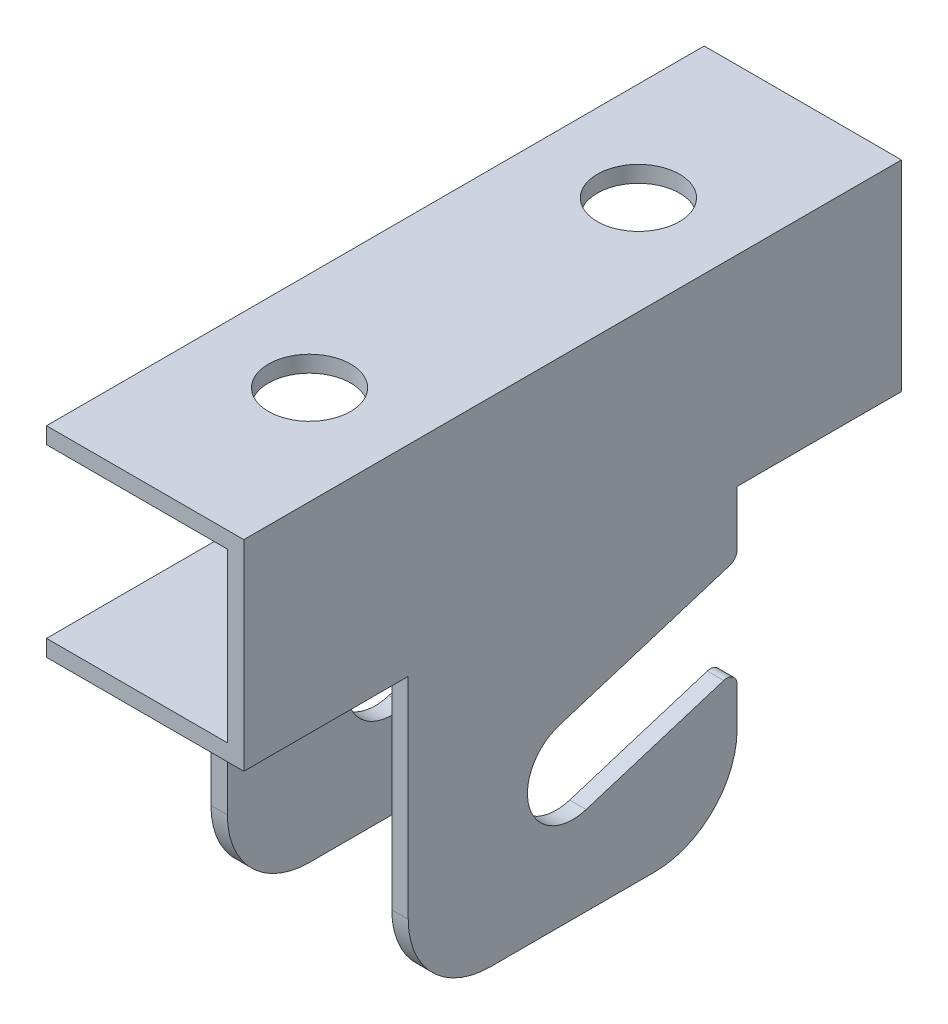
ISO-10303-21;
HEADER;
FILE_DESCRIPTION(('STEP AP214'),'2;1');
FILE_NAME('part.step','',(''),(''),'','','');
FILE_SCHEMA(('AUTOMOTIVE_DESIGN { 1 0 10303 214 1 1 1 1 }'));
ENDSEC;
DATA;
#1=APPLICATION_CONTEXT('core data for automotive mechanical design processes');
#2=APPLICATION_PROTOCOL_DEFINITION('international standard','automotive_design',2000,#1);
#3=PRODUCT_CONTEXT('',#1,'mechanical');
#4=PRODUCT('Part','Part','',(#3));
#5=PRODUCT_RELATED_PRODUCT_CATEGORY('part','',(#4));
#6=PRODUCT_DEFINITION_FORMATION('','',#4);
#7=PRODUCT_DEFINITION_CONTEXT('part definition',#1,'design');
#8=PRODUCT_DEFINITION('design','',#6,#7);
#9=PRODUCT_DEFINITION_SHAPE('','',#8);
#10=(LENGTH_UNIT() NAMED_UNIT(*) SI_UNIT(.MILLI.,.METRE.));
#11=(NAMED_UNIT(*) PLANE_ANGLE_UNIT() SI_UNIT($,.RADIAN.));
#12=(NAMED_UNIT(*) SI_UNIT($,.STERADIAN.) SOLID_ANGLE_UNIT());
#13=UNCERTAINTY_MEASURE_WITH_UNIT(LENGTH_MEASURE(1.E-05),#10,'distance_accuracy_value','');
#14=(GEOMETRIC_REPRESENTATION_CONTEXT(3) GLOBAL_UNCERTAINTY_ASSIGNED_CONTEXT((#13)) GLOBAL_UNIT_ASSIGNED_CONTEXT((#10,
#11,#12)) REPRESENTATION_CONTEXT('',''));
#15=CARTESIAN_POINT('',(0.,0.,0.));
#16=DIRECTION('',(0.,0.,1.));
#17=DIRECTION('',(1.,0.,0.));
#18=AXIS2_PLACEMENT_3D('',#15,#16,#17);
#19=CARTESIAN_POINT('',(0.,45.212,-25.4));
#20=DIRECTION('',(0.,0.,1.));
#21=DIRECTION('',(0.,-1.,0.));
#22=AXIS2_PLACEMENT_3D('',#19,#20,#21);
#23=PLANE('',#22);
#24=DIRECTION('',(0.,1.,0.));
#25=VECTOR('',#24,1.);
#26=CARTESIAN_POINT('',(30.48,76.2,-25.4));
#27=LINE('',#26,#25);
#28=CARTESIAN_POINT('',(30.48,36.7277490060236,-25.4));
#29=VERTEX_POINT('',#28);
#30=CARTESIAN_POINT('',(30.48,45.212,-25.4));
#31=VERTEX_POINT('',#30);
#32=EDGE_CURVE('E418',#29,#31,#27,.T.);
#33=ORIENTED_EDGE('',*,*,#32,.F.);
#34=DIRECTION('',(1.,0.,0.));
#35=VECTOR('',#34,1.);
#36=CARTESIAN_POINT('',(0.,36.7277490060236,-25.4));
#37=LINE('',#36,#35);
#38=CARTESIAN_POINT('',(27.94,36.7277490060236,-25.4));
#39=VERTEX_POINT('',#38);
#40=EDGE_CURVE('E495',#29,#39,#37,.F.);
#41=ORIENTED_EDGE('',*,*,#40,.T.);
#42=DIRECTION('',(0.,-1.,0.));
#43=VECTOR('',#42,1.);
#44=CARTESIAN_POINT('',(27.94,0.,-25.4));
#45=LINE('',#44,#43);
#46=CARTESIAN_POINT('',(27.94,45.212,-25.4));
#47=VERTEX_POINT('',#46);
#48=EDGE_CURVE('E336',#47,#39,#45,.T.);
#49=ORIENTED_EDGE('',*,*,#48,.F.);
#50=DIRECTION('',(1.,0.,0.));
#51=VECTOR('',#50,1.);
#52=CARTESIAN_POINT('',(0.,45.212,-25.4));
#53=LINE('',#52,#51);
#54=EDGE_CURVE('E327',#47,#31,#53,.T.);
#55=ORIENTED_EDGE('',*,*,#54,.T.);
#56=EDGE_LOOP('',(#33,#41,#49,#55));
#57=FACE_BOUND('',#56,.T.);
#58=ADVANCED_FACE('F41',(#57),#23,.F.);
#59=DIRECTION('',(0.,1.,0.));
#60=VECTOR('',#59,1.);
#61=CARTESIAN_POINT('',(2.54,45.212,-25.4));
#62=LINE('',#61,#60);
#63=CARTESIAN_POINT('',(2.54,36.7277490060236,-25.4));
#64=VERTEX_POINT('',#63);
#65=CARTESIAN_POINT('',(2.54,45.212,-25.4));
#66=VERTEX_POINT('',#65);
#67=EDGE_CURVE('E339',#64,#66,#62,.T.);
#68=ORIENTED_EDGE('',*,*,#67,.F.);
#69=DIRECTION('',(1.,0.,0.));
#70=VECTOR('',#69,1.);
#71=CARTESIAN_POINT('',(0.,36.7277490060236,-25.4));
#72=LINE('',#71,#70);
#73=CARTESIAN_POINT('',(0.,36.7277490060236,-25.4));
#74=VERTEX_POINT('',#73);
#75=EDGE_CURVE('E482',#64,#74,#72,.F.);
#76=ORIENTED_EDGE('',*,*,#75,.T.);
#77=DIRECTION('',(0.,-1.,0.));
#78=VECTOR('',#77,1.);
#79=CARTESIAN_POINT('',(0.,45.212,-25.4));
#80=LINE('',#79,#78);
#81=CARTESIAN_POINT('',(0.,45.212,-25.4));
#82=VERTEX_POINT('',#81);
#83=EDGE_CURVE('E325',#82,#74,#80,.T.);
#84=ORIENTED_EDGE('',*,*,#83,.F.);
#85=EDGE_CURVE('E314',#82,#66,#53,.T.);
#86=ORIENTED_EDGE('',*,*,#85,.T.);
#87=EDGE_LOOP('',(#68,#76,#84,#86));
#88=FACE_BOUND('',#87,.T.);
#89=ADVANCED_FACE('F564',(#88),#23,.F.);
#90=CARTESIAN_POINT('',(0.,0.,50.8));
#91=DIRECTION('',(1.,0.,0.));
#92=DIRECTION('',(0.,0.,-1.));
#93=AXIS2_PLACEMENT_3D('',#90,#91,#92);
#94=PLANE('',#93);
#95=ORIENTED_EDGE('',*,*,#83,.T.);
#96=CARTESIAN_POINT('',(0.,36.7277490060236,-23.8125));
#97=DIRECTION('',(1.,0.,0.));
#98=DIRECTION('',(0.,0.,-1.));
#99=AXIS2_PLACEMENT_3D('',#96,#97,#98);
#100=CIRCLE('',#99,1.5875);
#101=CARTESIAN_POINT('',(0.,35.212266999136,-24.2852267041325));
#102=VERTEX_POINT('',#101);
#103=EDGE_CURVE('E486',#74,#102,#100,.F.);
#104=ORIENTED_EDGE('',*,*,#103,.T.);
#105=DIRECTION('',(0.,-0.297780601028374,0.95463433504729));
#106=VECTOR('',#105,1.);
#107=CARTESIAN_POINT('',(0.,26.9881208303053,2.07999749818319));
#108=LINE('',#107,#106);
#109=CARTESIAN_POINT('',(0.,26.9881208303053,2.07999749818319));
#110=VERTEX_POINT('',#109);
#111=EDGE_CURVE('E270',#102,#110,#108,.T.);
#112=ORIENTED_EDGE('',*,*,#111,.T.);
#113=CARTESIAN_POINT('',(0.,20.32,0.));
#114=DIRECTION('',(1.,0.,0.));
#115=DIRECTION('',(0.,0.,-1.));
#116=AXIS2_PLACEMENT_3D('',#113,#114,#115);
#117=CIRCLE('',#116,6.985);
#118=CARTESIAN_POINT('',(0.,13.6518791696947,-2.07999749818319));
#119=VERTEX_POINT('',#118);
#120=EDGE_CURVE('E255',#110,#119,#117,.T.);
#121=ORIENTED_EDGE('',*,*,#120,.T.);
#122=DIRECTION('',(0.,0.297780601028374,-0.954634335047289));
#123=VECTOR('',#122,1.);
#124=CARTESIAN_POINT('',(0.,13.6518791696947,-2.07999749818319));
#125=LINE('',#124,#123);
#126=CARTESIAN_POINT('',(0.,20.2834747265937,-23.3397732958675));
#127=VERTEX_POINT('',#126);
#128=EDGE_CURVE('E264',#119,#127,#125,.T.);
#129=ORIENTED_EDGE('',*,*,#128,.T.);
#130=CARTESIAN_POINT('',(0.,18.7679927197062,-23.8125));
#131=DIRECTION('',(1.,0.,0.));
#132=DIRECTION('',(0.,0.,-1.));
#133=AXIS2_PLACEMENT_3D('',#130,#131,#132);
#134=CIRCLE('',#133,1.5875);
#135=CARTESIAN_POINT('',(0.,18.7679927197062,-25.4));
#136=VERTEX_POINT('',#135);
#137=EDGE_CURVE('E484',#127,#136,#134,.F.);
#138=ORIENTED_EDGE('',*,*,#137,.T.);
#139=CARTESIAN_POINT('',(0.,12.7,-25.4));
#140=VERTEX_POINT('',#139);
#141=EDGE_CURVE('E324',#136,#140,#80,.T.);
#142=ORIENTED_EDGE('',*,*,#141,.T.);
#143=CARTESIAN_POINT('',(0.,12.7,-12.7));
#144=DIRECTION('',(1.,0.,0.));
#145=DIRECTION('',(0.,0.,-1.));
#146=AXIS2_PLACEMENT_3D('',#143,#144,#145);
#147=CIRCLE('',#146,12.7);
#148=CARTESIAN_POINT('',(0.,0.,-12.7));
#149=VERTEX_POINT('',#148);
#150=EDGE_CURVE('E465',#140,#149,#147,.F.);
#151=ORIENTED_EDGE('',*,*,#150,.T.);
#152=DIRECTION('',(0.,0.,-1.));
#153=VECTOR('',#152,1.);
#154=CARTESIAN_POINT('',(0.,0.,50.8));
#155=LINE('',#154,#153);
#156=CARTESIAN_POINT('',(0.,0.,12.7));
#157=VERTEX_POINT('',#156);
#158=EDGE_CURVE('E415',#157,#149,#155,.T.);
#159=ORIENTED_EDGE('',*,*,#158,.F.);
#160=CARTESIAN_POINT('',(0.,12.7,12.7));
#161=DIRECTION('',(1.,0.,0.));
#162=DIRECTION('',(0.,0.,-1.));
#163=AXIS2_PLACEMENT_3D('',#160,#161,#162);
#164=CIRCLE('',#163,12.7);
#165=CARTESIAN_POINT('',(0.,12.7,25.4));
#166=VERTEX_POINT('',#165);
#167=EDGE_CURVE('E467',#157,#166,#164,.F.);
#168=ORIENTED_EDGE('',*,*,#167,.T.);
#169=DIRECTION('',(0.,1.,0.));
#170=VECTOR('',#169,1.);
#171=CARTESIAN_POINT('',(0.,45.212,25.4));
#172=LINE('',#171,#170);
#173=CARTESIAN_POINT('',(0.,45.212,25.4));
#174=VERTEX_POINT('',#173);
#175=EDGE_CURVE('E311',#166,#174,#172,.T.);
#176=ORIENTED_EDGE('',*,*,#175,.T.);
#177=DIRECTION('',(0.,0.,1.));
#178=VECTOR('',#177,1.);
#179=CARTESIAN_POINT('',(0.,45.212,50.8));
#180=LINE('',#179,#178);
#181=CARTESIAN_POINT('',(0.,45.212,50.8));
#182=VERTEX_POINT('',#181);
#183=EDGE_CURVE('E313',#174,#182,#180,.T.);
#184=ORIENTED_EDGE('',*,*,#183,.T.);
#185=DIRECTION('',(0.,-1.,0.));
#186=VECTOR('',#185,1.);
#187=CARTESIAN_POINT('',(0.,0.,50.8));
#188=LINE('',#187,#186);
#189=CARTESIAN_POINT('',(0.,47.752,50.8));
#190=VERTEX_POINT('',#189);
#191=EDGE_CURVE('E349',#190,#182,#188,.T.);
#192=ORIENTED_EDGE('',*,*,#191,.F.);
#193=DIRECTION('',(0.,0.,-1.));
#194=VECTOR('',#193,1.);
#195=CARTESIAN_POINT('',(0.,47.752,50.8));
#196=LINE('',#195,#194);
#197=CARTESIAN_POINT('',(0.,47.752,-50.8));
#198=VERTEX_POINT('',#197);
#199=EDGE_CURVE('E367',#190,#198,#196,.T.);
#200=ORIENTED_EDGE('',*,*,#199,.T.);
#201=DIRECTION('',(0.,-1.,0.));
#202=VECTOR('',#201,1.);
#203=CARTESIAN_POINT('',(0.,0.,-50.8));
#204=LINE('',#203,#202);
#205=CARTESIAN_POINT('',(0.,45.212,-50.8));
#206=VERTEX_POINT('',#205);
#207=EDGE_CURVE('E348',#198,#206,#204,.T.);
#208=ORIENTED_EDGE('',*,*,#207,.T.);
#209=DIRECTION('',(0.,0.,1.));
#210=VECTOR('',#209,1.);
#211=CARTESIAN_POINT('',(0.,45.212,-50.8));
#212=LINE('',#211,#210);
#213=EDGE_CURVE('E310',#206,#82,#212,.T.);
#214=ORIENTED_EDGE('',*,*,#213,.T.);
#215=EDGE_LOOP('',(#95,#104,#112,#121,#129,#138,#142,#151,#159,#168,#176,#184,#192,#200,#208,#214));
#216=FACE_BOUND('',#215,.T.);
#217=ADVANCED_FACE('F273',(#216),#94,.F.);
#218=CARTESIAN_POINT('',(2.54,0.,50.8));
#219=DIRECTION('',(0.,1.,0.));
#220=DIRECTION('',(-1.,0.,0.));
#221=AXIS2_PLACEMENT_3D('',#218,#219,#220);
#222=PLANE('',#221);
#223=DIRECTION('',(0.,0.,-1.));
#224=VECTOR('',#223,1.);
#225=CARTESIAN_POINT('',(2.54,0.,50.8));
#226=LINE('',#225,#224);
#227=CARTESIAN_POINT('',(2.54,0.,12.7));
#228=VERTEX_POINT('',#227);
#229=CARTESIAN_POINT('',(2.54,0.,-12.7));
#230=VERTEX_POINT('',#229);
#231=EDGE_CURVE('E412',#228,#230,#226,.T.);
#232=ORIENTED_EDGE('',*,*,#231,.F.);
#233=DIRECTION('',(1.,0.,0.));
#234=VECTOR('',#233,1.);
#235=CARTESIAN_POINT('',(2.54,0.,12.7));
#236=LINE('',#235,#234);
#237=EDGE_CURVE('E463',#228,#157,#236,.F.);
#238=ORIENTED_EDGE('',*,*,#237,.T.);
#239=ORIENTED_EDGE('',*,*,#158,.T.);
#240=DIRECTION('',(1.,0.,0.));
#241=VECTOR('',#240,1.);
#242=CARTESIAN_POINT('',(2.54,0.,-12.7));
#243=LINE('',#242,#241);
#244=EDGE_CURVE('E460',#149,#230,#243,.T.);
#245=ORIENTED_EDGE('',*,*,#244,.T.);
#246=EDGE_LOOP('',(#232,#238,#239,#245));
#247=FACE_BOUND('',#246,.T.);
#248=ADVANCED_FACE('F597',(#247),#222,.F.);
#249=CARTESIAN_POINT('',(2.54,45.212,50.8));
#250=DIRECTION('',(-1.,0.,0.));
#251=DIRECTION('',(0.,-1.,0.));
#252=AXIS2_PLACEMENT_3D('',#249,#250,#251);
#253=PLANE('',#252);
#254=DIRECTION('',(0.,0.297780601028374,-0.954634335047289));
#255=VECTOR('',#254,1.);
#256=CARTESIAN_POINT('',(2.54,14.7543797026228,41.2993062316392));
#257=LINE('',#256,#255);
#258=CARTESIAN_POINT('',(2.54,26.9881208303053,2.07999749818319));
#259=VERTEX_POINT('',#258);
#260=CARTESIAN_POINT('',(2.54,35.212266999136,-24.2852267041325));
#261=VERTEX_POINT('',#260);
#262=EDGE_CURVE('E303',#259,#261,#257,.T.);
#263=ORIENTED_EDGE('',*,*,#262,.T.);
#264=CARTESIAN_POINT('',(2.54,36.7277490060236,-23.8125));
#265=DIRECTION('',(-1.,0.,0.));
#266=DIRECTION('',(0.,-1.,0.));
#267=AXIS2_PLACEMENT_3D('',#264,#265,#266);
#268=CIRCLE('',#267,1.5875);
#269=EDGE_CURVE('E480',#261,#64,#268,.F.);
#270=ORIENTED_EDGE('',*,*,#269,.T.);
#271=ORIENTED_EDGE('',*,*,#67,.T.);
#272=DIRECTION('',(0.,0.,-1.));
#273=VECTOR('',#272,1.);
#274=CARTESIAN_POINT('',(2.54,45.212,50.8));
#275=LINE('',#274,#273);
#276=CARTESIAN_POINT('',(2.54,45.212,25.4));
#277=VERTEX_POINT('',#276);
#278=EDGE_CURVE('E409',#277,#66,#275,.T.);
#279=ORIENTED_EDGE('',*,*,#278,.F.);
#280=DIRECTION('',(0.,-1.,0.));
#281=VECTOR('',#280,1.);
#282=CARTESIAN_POINT('',(2.54,45.212,25.4));
#283=LINE('',#282,#281);
#284=CARTESIAN_POINT('',(2.54,12.7,25.4));
#285=VERTEX_POINT('',#284);
#286=EDGE_CURVE('E345',#277,#285,#283,.T.);
#287=ORIENTED_EDGE('',*,*,#286,.T.);
#288=CARTESIAN_POINT('',(2.54,12.7,12.7));
#289=DIRECTION('',(-1.,0.,0.));
#290=DIRECTION('',(0.,-1.,0.));
#291=AXIS2_PLACEMENT_3D('',#288,#289,#290);
#292=CIRCLE('',#291,12.7);
#293=EDGE_CURVE('E458',#285,#228,#292,.F.);
#294=ORIENTED_EDGE('',*,*,#293,.T.);
#295=ORIENTED_EDGE('',*,*,#231,.T.);
#296=CARTESIAN_POINT('',(2.54,12.7,-12.7));
#297=DIRECTION('',(-1.,0.,0.));
#298=DIRECTION('',(0.,-1.,0.));
#299=AXIS2_PLACEMENT_3D('',#296,#297,#298);
#300=CIRCLE('',#299,12.7);
#301=CARTESIAN_POINT('',(2.54,12.7,-25.4));
#302=VERTEX_POINT('',#301);
#303=EDGE_CURVE('E456',#230,#302,#300,.F.);
#304=ORIENTED_EDGE('',*,*,#303,.T.);
#305=CARTESIAN_POINT('',(2.54,18.7679927197062,-25.4));
#306=VERTEX_POINT('',#305);
#307=EDGE_CURVE('E340',#302,#306,#62,.T.);
#308=ORIENTED_EDGE('',*,*,#307,.T.);
#309=CARTESIAN_POINT('',(2.54,18.7679927197062,-23.8125));
#310=DIRECTION('',(-1.,0.,0.));
#311=DIRECTION('',(0.,-1.,0.));
#312=AXIS2_PLACEMENT_3D('',#309,#310,#311);
#313=CIRCLE('',#312,1.5875);
#314=CARTESIAN_POINT('',(2.54,20.2834747265937,-23.3397732958675));
#315=VERTEX_POINT('',#314);
#316=EDGE_CURVE('E478',#306,#315,#313,.F.);
#317=ORIENTED_EDGE('',*,*,#316,.T.);
#318=DIRECTION('',(0.,-0.297780601028374,0.95463433504729));
#319=VECTOR('',#318,1.);
#320=CARTESIAN_POINT('',(2.54,1.41813804201213,37.1393112352729));
#321=LINE('',#320,#319);
#322=CARTESIAN_POINT('',(2.54,13.6518791696947,-2.07999749818319));
#323=VERTEX_POINT('',#322);
#324=EDGE_CURVE('E296',#315,#323,#321,.T.);
#325=ORIENTED_EDGE('',*,*,#324,.T.);
#326=CARTESIAN_POINT('',(2.54,20.32,0.));
#327=DIRECTION('',(-1.,0.,0.));
#328=DIRECTION('',(0.,-1.,0.));
#329=AXIS2_PLACEMENT_3D('',#326,#327,#328);
#330=CIRCLE('',#329,6.985);
#331=EDGE_CURVE('E257',#323,#259,#330,.T.);
#332=ORIENTED_EDGE('',*,*,#331,.T.);
#333=EDGE_LOOP('',(#263,#270,#271,#279,#287,#294,#295,#304,#308,#317,#325,#332));
#334=FACE_BOUND('',#333,.T.);
#335=ADVANCED_FACE('F589',(#334),#253,.F.);
#336=CARTESIAN_POINT('',(27.94,45.212,50.8));
#337=DIRECTION('',(0.,1.,0.));
#338=DIRECTION('',(0.,0.,1.));
#339=AXIS2_PLACEMENT_3D('',#336,#337,#338);
#340=PLANE('',#339);
#341=CARTESIAN_POINT('',(15.24,45.212,25.4));
#342=DIRECTION('',(0.,1.,0.));
#343=DIRECTION('',(0.,0.,1.));
#344=AXIS2_PLACEMENT_3D('',#341,#342,#343);
#345=CIRCLE('',#344,6.35);
#346=CARTESIAN_POINT('',(15.24,45.212,31.75));
#347=VERTEX_POINT('',#346);
#348=EDGE_CURVE('E276',#347,#347,#345,.T.);
#349=ORIENTED_EDGE('',*,*,#348,.T.);
#350=EDGE_LOOP('',(#349));
#351=FACE_BOUND('',#350,.T.);
#352=CARTESIAN_POINT('',(15.24,45.212,-25.4));
#353=DIRECTION('',(0.,1.,0.));
#354=DIRECTION('',(0.,0.,1.));
#355=AXIS2_PLACEMENT_3D('',#352,#353,#354);
#356=CIRCLE('',#355,6.35);
#357=CARTESIAN_POINT('',(15.24,45.212,-19.05));
#358=VERTEX_POINT('',#357);
#359=EDGE_CURVE('E437',#358,#358,#356,.T.);
#360=ORIENTED_EDGE('',*,*,#359,.T.);
#361=EDGE_LOOP('',(#360));
#362=FACE_BOUND('',#361,.T.);
#363=DIRECTION('',(0.,0.,-1.));
#364=VECTOR('',#363,1.);
#365=CARTESIAN_POINT('',(27.94,45.212,50.8));
#366=LINE('',#365,#364);
#367=CARTESIAN_POINT('',(27.94,45.212,25.4));
#368=VERTEX_POINT('',#367);
#369=EDGE_CURVE('E406',#368,#47,#366,.T.);
#370=ORIENTED_EDGE('',*,*,#369,.F.);
#371=DIRECTION('',(1.,0.,0.));
#372=VECTOR('',#371,1.);
#373=CARTESIAN_POINT('',(0.,45.212,25.4));
#374=LINE('',#373,#372);
#375=CARTESIAN_POINT('',(30.48,45.212,25.4));
#376=VERTEX_POINT('',#375);
#377=EDGE_CURVE('E317',#368,#376,#374,.T.);
#378=ORIENTED_EDGE('',*,*,#377,.T.);
#379=DIRECTION('',(0.,0.,-1.));
#380=VECTOR('',#379,1.);
#381=CARTESIAN_POINT('',(30.48,45.212,50.8));
#382=LINE('',#381,#380);
#383=CARTESIAN_POINT('',(30.48,45.212,50.8));
#384=VERTEX_POINT('',#383);
#385=EDGE_CURVE('E332',#384,#376,#382,.T.);
#386=ORIENTED_EDGE('',*,*,#385,.F.);
#387=DIRECTION('',(1.,0.,0.));
#388=VECTOR('',#387,1.);
#389=CARTESIAN_POINT('',(27.94,45.212,50.8));
#390=LINE('',#389,#388);
#391=EDGE_CURVE('E352',#182,#384,#390,.T.);
#392=ORIENTED_EDGE('',*,*,#391,.F.);
#393=ORIENTED_EDGE('',*,*,#183,.F.);
#394=EDGE_CURVE('E318',#174,#277,#374,.T.);
#395=ORIENTED_EDGE('',*,*,#394,.T.);
#396=ORIENTED_EDGE('',*,*,#278,.T.);
#397=ORIENTED_EDGE('',*,*,#85,.F.);
#398=ORIENTED_EDGE('',*,*,#213,.F.);
#399=DIRECTION('',(1.,0.,0.));
#400=VECTOR('',#399,1.);
#401=CARTESIAN_POINT('',(27.94,45.212,-50.8));
#402=LINE('',#401,#400);
#403=CARTESIAN_POINT('',(30.48,45.212,-50.8));
#404=VERTEX_POINT('',#403);
#405=EDGE_CURVE('E370',#206,#404,#402,.T.);
#406=ORIENTED_EDGE('',*,*,#405,.T.);
#407=DIRECTION('',(0.,0.,-1.));
#408=VECTOR('',#407,1.);
#409=CARTESIAN_POINT('',(30.48,45.212,50.8));
#410=LINE('',#409,#408);
#411=EDGE_CURVE('E321',#31,#404,#410,.T.);
#412=ORIENTED_EDGE('',*,*,#411,.F.);
#413=ORIENTED_EDGE('',*,*,#54,.F.);
#414=EDGE_LOOP('',(#370,#378,#386,#392,#393,#395,#396,#397,#398,#406,#412,#413));
#415=FACE_BOUND('',#414,.T.);
#416=ADVANCED_FACE('F536',(#351,#362,#415),#340,.F.);
#417=CARTESIAN_POINT('',(27.94,0.,50.8));
#418=DIRECTION('',(1.,0.,0.));
#419=DIRECTION('',(0.,1.,0.));
#420=AXIS2_PLACEMENT_3D('',#417,#418,#419);
#421=PLANE('',#420);
#422=ORIENTED_EDGE('',*,*,#48,.T.);
#423=CARTESIAN_POINT('',(27.94,36.7277490060236,-23.8125));
#424=DIRECTION('',(1.,0.,0.));
#425=DIRECTION('',(0.,1.,0.));
#426=AXIS2_PLACEMENT_3D('',#423,#424,#425);
#427=CIRCLE('',#426,1.5875);
#428=CARTESIAN_POINT('',(27.94,35.212266999136,-24.2852267041326));
#429=VERTEX_POINT('',#428);
#430=EDGE_CURVE('E498',#39,#429,#427,.F.);
#431=ORIENTED_EDGE('',*,*,#430,.T.);
#432=DIRECTION('',(0.,-0.297780601028374,0.954634335047289));
#433=VECTOR('',#432,1.);
#434=CARTESIAN_POINT('',(27.94,10.7452830802199,54.1517931802541));
#435=LINE('',#434,#433);
#436=CARTESIAN_POINT('',(27.94,26.9881208303053,2.07999749818319));
#437=VERTEX_POINT('',#436);
#438=EDGE_CURVE('E301',#429,#437,#435,.T.);
#439=ORIENTED_EDGE('',*,*,#438,.T.);
#440=CARTESIAN_POINT('',(27.94,20.32,0.));
#441=DIRECTION('',(1.,0.,0.));
#442=DIRECTION('',(0.,1.,0.));
#443=AXIS2_PLACEMENT_3D('',#440,#441,#442);
#444=CIRCLE('',#443,6.985);
#445=CARTESIAN_POINT('',(27.94,13.6518791696947,-2.07999749818319));
#446=VERTEX_POINT('',#445);
#447=EDGE_CURVE('E306',#437,#446,#444,.T.);
#448=ORIENTED_EDGE('',*,*,#447,.T.);
#449=DIRECTION('',(0.,0.297780601028374,-0.95463433504729));
#450=VECTOR('',#449,1.);
#451=CARTESIAN_POINT('',(27.94,-2.59095858039068,49.9917981838877));
#452=LINE('',#451,#450);
#453=CARTESIAN_POINT('',(27.94,20.2834747265937,-23.3397732958675));
#454=VERTEX_POINT('',#453);
#455=EDGE_CURVE('E294',#446,#454,#452,.T.);
#456=ORIENTED_EDGE('',*,*,#455,.T.);
#457=CARTESIAN_POINT('',(27.94,18.7679927197062,-23.8125));
#458=DIRECTION('',(1.,0.,0.));
#459=DIRECTION('',(0.,1.,0.));
#460=AXIS2_PLACEMENT_3D('',#457,#458,#459);
#461=CIRCLE('',#460,1.5875);
#462=CARTESIAN_POINT('',(27.94,18.7679927197062,-25.4));
#463=VERTEX_POINT('',#462);
#464=EDGE_CURVE('E56',#454,#463,#461,.F.);
#465=ORIENTED_EDGE('',*,*,#464,.T.);
#466=CARTESIAN_POINT('',(27.94,12.7,-25.4));
#467=VERTEX_POINT('',#466);
#468=EDGE_CURVE('E335',#463,#467,#45,.T.);
#469=ORIENTED_EDGE('',*,*,#468,.T.);
#470=CARTESIAN_POINT('',(27.94,12.7,-12.7));
#471=DIRECTION('',(1.,0.,0.));
#472=DIRECTION('',(0.,1.,0.));
#473=AXIS2_PLACEMENT_3D('',#470,#471,#472);
#474=CIRCLE('',#473,12.7);
#475=CARTESIAN_POINT('',(27.94,0.,-12.7));
#476=VERTEX_POINT('',#475);
#477=EDGE_CURVE('E449',#467,#476,#474,.F.);
#478=ORIENTED_EDGE('',*,*,#477,.T.);
#479=DIRECTION('',(0.,0.,-1.));
#480=VECTOR('',#479,1.);
#481=CARTESIAN_POINT('',(27.94,0.,50.8));
#482=LINE('',#481,#480);
#483=CARTESIAN_POINT('',(27.94,0.,12.7));
#484=VERTEX_POINT('',#483);
#485=EDGE_CURVE('E403',#484,#476,#482,.T.);
#486=ORIENTED_EDGE('',*,*,#485,.F.);
#487=CARTESIAN_POINT('',(27.94,12.7,12.7));
#488=DIRECTION('',(1.,0.,0.));
#489=DIRECTION('',(0.,1.,0.));
#490=AXIS2_PLACEMENT_3D('',#487,#488,#489);
#491=CIRCLE('',#490,12.7);
#492=CARTESIAN_POINT('',(27.94,12.7,25.4));
#493=VERTEX_POINT('',#492);
#494=EDGE_CURVE('E451',#484,#493,#491,.F.);
#495=ORIENTED_EDGE('',*,*,#494,.T.);
#496=DIRECTION('',(0.,1.,0.));
#497=VECTOR('',#496,1.);
#498=CARTESIAN_POINT('',(27.94,0.,25.4));
#499=LINE('',#498,#497);
#500=EDGE_CURVE('E343',#493,#368,#499,.T.);
#501=ORIENTED_EDGE('',*,*,#500,.T.);
#502=ORIENTED_EDGE('',*,*,#369,.T.);
#503=EDGE_LOOP('',(#422,#431,#439,#448,#456,#465,#469,#478,#486,#495,#501,#502));
#504=FACE_BOUND('',#503,.T.);
#505=ADVANCED_FACE('F522',(#504),#421,.F.);
#506=CARTESIAN_POINT('',(30.48,0.,50.8));
#507=DIRECTION('',(0.,1.,0.));
#508=DIRECTION('',(-1.,0.,0.));
#509=AXIS2_PLACEMENT_3D('',#506,#507,#508);
#510=PLANE('',#509);
#511=DIRECTION('',(0.,0.,-1.));
#512=VECTOR('',#511,1.);
#513=CARTESIAN_POINT('',(30.48,0.,50.8));
#514=LINE('',#513,#512);
#515=CARTESIAN_POINT('',(30.48,0.,12.7));
#516=VERTEX_POINT('',#515);
#517=CARTESIAN_POINT('',(30.48,0.,-12.7));
#518=VERTEX_POINT('',#517);
#519=EDGE_CURVE('E400',#516,#518,#514,.T.);
#520=ORIENTED_EDGE('',*,*,#519,.F.);
#521=DIRECTION('',(1.,0.,0.));
#522=VECTOR('',#521,1.);
#523=CARTESIAN_POINT('',(30.48,0.,12.7));
#524=LINE('',#523,#522);
#525=EDGE_CURVE('E447',#516,#484,#524,.F.);
#526=ORIENTED_EDGE('',*,*,#525,.T.);
#527=ORIENTED_EDGE('',*,*,#485,.T.);
#528=DIRECTION('',(1.,0.,0.));
#529=VECTOR('',#528,1.);
#530=CARTESIAN_POINT('',(30.48,0.,-12.7));
#531=LINE('',#530,#529);
#532=EDGE_CURVE('E444',#476,#518,#531,.T.);
#533=ORIENTED_EDGE('',*,*,#532,.T.);
#534=EDGE_LOOP('',(#520,#526,#527,#533));
#535=FACE_BOUND('',#534,.T.);
#536=ADVANCED_FACE('F518',(#535),#510,.F.);
#537=CARTESIAN_POINT('',(30.48,76.2,50.8));
#538=DIRECTION('',(-1.,0.,0.));
#539=DIRECTION('',(0.,0.,1.));
#540=AXIS2_PLACEMENT_3D('',#537,#538,#539);
#541=PLANE('',#540);
#542=DIRECTION('',(0.,0.297780601028374,-0.954634335047289));
#543=VECTOR('',#542,1.);
#544=CARTESIAN_POINT('',(30.48,17.5021875,32.4902983230381));
#545=LINE('',#544,#543);
#546=CARTESIAN_POINT('',(30.48,26.9881208303053,2.07999749818319));
#547=VERTEX_POINT('',#546);
#548=CARTESIAN_POINT('',(30.48,35.212266999136,-24.2852267041325));
#549=VERTEX_POINT('',#548);
#550=EDGE_CURVE('E298',#547,#549,#545,.T.);
#551=ORIENTED_EDGE('',*,*,#550,.T.);
#552=CARTESIAN_POINT('',(30.48,36.7277490060236,-23.8125));
#553=DIRECTION('',(-1.,0.,0.));
#554=DIRECTION('',(0.,0.,1.));
#555=AXIS2_PLACEMENT_3D('',#552,#553,#554);
#556=CIRCLE('',#555,1.5875);
#557=EDGE_CURVE('E493',#549,#29,#556,.F.);
#558=ORIENTED_EDGE('',*,*,#557,.T.);
#559=ORIENTED_EDGE('',*,*,#32,.T.);
#560=ORIENTED_EDGE('',*,*,#411,.T.);
#561=DIRECTION('',(0.,1.,0.));
#562=VECTOR('',#561,1.);
#563=CARTESIAN_POINT('',(30.48,76.2,-50.8));
#564=LINE('',#563,#562);
#565=CARTESIAN_POINT('',(30.48,76.2,-50.8));
#566=VERTEX_POINT('',#565);
#567=EDGE_CURVE('E372',#404,#566,#564,.T.);
#568=ORIENTED_EDGE('',*,*,#567,.T.);
#569=DIRECTION('',(0.,0.,-1.));
#570=VECTOR('',#569,1.);
#571=CARTESIAN_POINT('',(30.48,76.2,50.8));
#572=LINE('',#571,#570);
#573=CARTESIAN_POINT('',(30.48,76.2,50.8));
#574=VERTEX_POINT('',#573);
#575=EDGE_CURVE('E397',#574,#566,#572,.T.);
#576=ORIENTED_EDGE('',*,*,#575,.F.);
#577=DIRECTION('',(0.,1.,0.));
#578=VECTOR('',#577,1.);
#579=CARTESIAN_POINT('',(30.48,47.752,50.8));
#580=LINE('',#579,#578);
#581=EDGE_CURVE('E355',#384,#574,#580,.T.);
#582=ORIENTED_EDGE('',*,*,#581,.F.);
#583=ORIENTED_EDGE('',*,*,#385,.T.);
#584=DIRECTION('',(0.,-1.,0.));
#585=VECTOR('',#584,1.);
#586=CARTESIAN_POINT('',(30.48,76.2,25.4));
#587=LINE('',#586,#585);
#588=CARTESIAN_POINT('',(30.48,12.7,25.4));
#589=VERTEX_POINT('',#588);
#590=EDGE_CURVE('E422',#376,#589,#587,.T.);
#591=ORIENTED_EDGE('',*,*,#590,.T.);
#592=CARTESIAN_POINT('',(30.48,12.7,12.7));
#593=DIRECTION('',(-1.,0.,0.));
#594=DIRECTION('',(0.,0.,1.));
#595=AXIS2_PLACEMENT_3D('',#592,#593,#594);
#596=CIRCLE('',#595,12.7);
#597=EDGE_CURVE('E442',#589,#516,#596,.F.);
#598=ORIENTED_EDGE('',*,*,#597,.T.);
#599=ORIENTED_EDGE('',*,*,#519,.T.);
#600=CARTESIAN_POINT('',(30.48,12.7,-12.7));
#601=DIRECTION('',(-1.,0.,0.));
#602=DIRECTION('',(0.,0.,1.));
#603=AXIS2_PLACEMENT_3D('',#600,#601,#602);
#604=CIRCLE('',#603,12.7);
#605=CARTESIAN_POINT('',(30.48,12.7,-25.4));
#606=VERTEX_POINT('',#605);
#607=EDGE_CURVE('E440',#518,#606,#604,.F.);
#608=ORIENTED_EDGE('',*,*,#607,.T.);
#609=CARTESIAN_POINT('',(30.48,18.7679927197062,-25.4));
#610=VERTEX_POINT('',#609);
#611=EDGE_CURVE('E419',#606,#610,#27,.T.);
#612=ORIENTED_EDGE('',*,*,#611,.T.);
#613=CARTESIAN_POINT('',(30.48,18.7679927197062,-23.8125));
#614=DIRECTION('',(-1.,0.,0.));
#615=DIRECTION('',(0.,0.,1.));
#616=AXIS2_PLACEMENT_3D('',#613,#614,#615);
#617=CIRCLE('',#616,1.5875);
#618=CARTESIAN_POINT('',(30.48,20.2834747265937,-23.3397732958675));
#619=VERTEX_POINT('',#618);
#620=EDGE_CURVE('E491',#610,#619,#617,.F.);
#621=ORIENTED_EDGE('',*,*,#620,.T.);
#622=DIRECTION('',(0.,-0.297780601028374,0.95463433504729));
#623=VECTOR('',#622,1.);
#624=CARTESIAN_POINT('',(30.48,4.16594583938934,28.3303033266717));
#625=LINE('',#624,#623);
#626=CARTESIAN_POINT('',(30.48,13.6518791696947,-2.07999749818319));
#627=VERTEX_POINT('',#626);
#628=EDGE_CURVE('E286',#619,#627,#625,.T.);
#629=ORIENTED_EDGE('',*,*,#628,.T.);
#630=CARTESIAN_POINT('',(30.48,20.32,0.));
#631=DIRECTION('',(1.,0.,0.));
#632=DIRECTION('',(0.,0.,-1.));
#633=AXIS2_PLACEMENT_3D('',#630,#631,#632);
#634=CIRCLE('',#633,6.985);
#635=EDGE_CURVE('E425',#627,#547,#634,.F.);
#636=ORIENTED_EDGE('',*,*,#635,.T.);
#637=EDGE_LOOP('',(#551,#558,#559,#560,#568,#576,#582,#583,#591,#598,#599,#608,#612,#621,#629,#636));
#638=FACE_BOUND('',#637,.T.);
#639=ADVANCED_FACE('F511',(#638),#541,.F.);
#640=CARTESIAN_POINT('',(0.,76.2,50.8));
#641=DIRECTION('',(0.,-1.,0.));
#642=DIRECTION('',(0.,0.,-1.));
#643=AXIS2_PLACEMENT_3D('',#640,#641,#642);
#644=PLANE('',#643);
#645=CARTESIAN_POINT('',(15.24,76.2,25.4));
#646=DIRECTION('',(0.,1.,0.));
#647=DIRECTION('',(0.,0.,1.));
#648=AXIS2_PLACEMENT_3D('',#645,#646,#647);
#649=CIRCLE('',#648,6.35);
#650=CARTESIAN_POINT('',(15.24,76.2,31.75));
#651=VERTEX_POINT('',#650);
#652=EDGE_CURVE('E433',#651,#651,#649,.T.);
#653=ORIENTED_EDGE('',*,*,#652,.F.);
#654=EDGE_LOOP('',(#653));
#655=FACE_BOUND('',#654,.T.);
#656=CARTESIAN_POINT('',(15.24,76.2,-25.4));
#657=DIRECTION('',(0.,1.,0.));
#658=DIRECTION('',(0.,0.,1.));
#659=AXIS2_PLACEMENT_3D('',#656,#657,#658);
#660=CIRCLE('',#659,6.35);
#661=CARTESIAN_POINT('',(15.24,76.2,-19.05));
#662=VERTEX_POINT('',#661);
#663=EDGE_CURVE('E946',#662,#662,#660,.T.);
#664=ORIENTED_EDGE('',*,*,#663,.F.);
#665=EDGE_LOOP('',(#664));
#666=FACE_BOUND('',#665,.T.);
#667=DIRECTION('',(-1.,0.,0.));
#668=VECTOR('',#667,1.);
#669=CARTESIAN_POINT('',(0.,76.2,-50.8));
#670=LINE('',#669,#668);
#671=CARTESIAN_POINT('',(0.,76.2,-50.8));
#672=VERTEX_POINT('',#671);
#673=EDGE_CURVE('E374',#566,#672,#670,.T.);
#674=ORIENTED_EDGE('',*,*,#673,.T.);
#675=DIRECTION('',(0.,0.,-1.));
#676=VECTOR('',#675,1.);
#677=CARTESIAN_POINT('',(0.,76.2,50.8));
#678=LINE('',#677,#676);
#679=CARTESIAN_POINT('',(0.,76.2,50.8));
#680=VERTEX_POINT('',#679);
#681=EDGE_CURVE('E394',#680,#672,#678,.T.);
#682=ORIENTED_EDGE('',*,*,#681,.F.);
#683=DIRECTION('',(-1.,0.,0.));
#684=VECTOR('',#683,1.);
#685=CARTESIAN_POINT('',(0.,76.2,50.8));
#686=LINE('',#685,#684);
#687=EDGE_CURVE('E357',#574,#680,#686,.T.);
#688=ORIENTED_EDGE('',*,*,#687,.F.);
#689=ORIENTED_EDGE('',*,*,#575,.T.);
#690=EDGE_LOOP('',(#674,#682,#688,#689));
#691=FACE_BOUND('',#690,.T.);
#692=ADVANCED_FACE('F744',(#655,#666,#691),#644,.F.);
#693=CARTESIAN_POINT('',(0.,76.2,50.8));
#694=DIRECTION('',(1.,0.,0.));
#695=DIRECTION('',(0.,0.,-1.));
#696=AXIS2_PLACEMENT_3D('',#693,#694,#695);
#697=PLANE('',#696);
#698=DIRECTION('',(0.,-1.,0.));
#699=VECTOR('',#698,1.);
#700=CARTESIAN_POINT('',(0.,76.2,-50.8));
#701=LINE('',#700,#699);
#702=CARTESIAN_POINT('',(0.,73.66,-50.8));
#703=VERTEX_POINT('',#702);
#704=EDGE_CURVE('E376',#672,#703,#701,.T.);
#705=ORIENTED_EDGE('',*,*,#704,.T.);
#706=DIRECTION('',(0.,0.,-1.));
#707=VECTOR('',#706,1.);
#708=CARTESIAN_POINT('',(0.,73.66,50.8));
#709=LINE('',#708,#707);
#710=CARTESIAN_POINT('',(0.,73.66,50.8));
#711=VERTEX_POINT('',#710);
#712=EDGE_CURVE('E391',#711,#703,#709,.T.);
#713=ORIENTED_EDGE('',*,*,#712,.F.);
#714=DIRECTION('',(0.,-1.,0.));
#715=VECTOR('',#714,1.);
#716=CARTESIAN_POINT('',(0.,76.2,50.8));
#717=LINE('',#716,#715);
#718=EDGE_CURVE('E359',#680,#711,#717,.T.);
#719=ORIENTED_EDGE('',*,*,#718,.F.);
#720=ORIENTED_EDGE('',*,*,#681,.T.);
#721=EDGE_LOOP('',(#705,#713,#719,#720));
#722=FACE_BOUND('',#721,.T.);
#723=ADVANCED_FACE('F734',(#722),#697,.F.);
#724=CARTESIAN_POINT('',(27.94,73.66,50.8));
#725=DIRECTION('',(0.,1.,0.));
#726=DIRECTION('',(0.,0.,1.));
#727=AXIS2_PLACEMENT_3D('',#724,#725,#726);
#728=PLANE('',#727);
#729=CARTESIAN_POINT('',(15.24,73.66,25.4));
#730=DIRECTION('',(0.,1.,0.));
#731=DIRECTION('',(0.,0.,1.));
#732=AXIS2_PLACEMENT_3D('',#729,#730,#731);
#733=CIRCLE('',#732,6.35);
#734=CARTESIAN_POINT('',(15.24,73.66,31.75));
#735=VERTEX_POINT('',#734);
#736=EDGE_CURVE('E279',#735,#735,#733,.T.);
#737=ORIENTED_EDGE('',*,*,#736,.T.);
#738=EDGE_LOOP('',(#737));
#739=FACE_BOUND('',#738,.T.);
#740=CARTESIAN_POINT('',(15.24,73.66,-25.4));
#741=DIRECTION('',(0.,1.,0.));
#742=DIRECTION('',(0.,0.,1.));
#743=AXIS2_PLACEMENT_3D('',#740,#741,#742);
#744=CIRCLE('',#743,6.35);
#745=CARTESIAN_POINT('',(15.24,73.66,-19.05));
#746=VERTEX_POINT('',#745);
#747=EDGE_CURVE('E432',#746,#746,#744,.T.);
#748=ORIENTED_EDGE('',*,*,#747,.T.);
#749=EDGE_LOOP('',(#748));
#750=FACE_BOUND('',#749,.T.);
#751=DIRECTION('',(1.,0.,0.));
#752=VECTOR('',#751,1.);
#753=CARTESIAN_POINT('',(27.94,73.66,-50.8));
#754=LINE('',#753,#752);
#755=CARTESIAN_POINT('',(27.94,73.66,-50.8));
#756=VERTEX_POINT('',#755);
#757=EDGE_CURVE('E378',#703,#756,#754,.T.);
#758=ORIENTED_EDGE('',*,*,#757,.T.);
#759=DIRECTION('',(0.,0.,-1.));
#760=VECTOR('',#759,1.);
#761=CARTESIAN_POINT('',(27.94,73.66,50.8));
#762=LINE('',#761,#760);
#763=CARTESIAN_POINT('',(27.94,73.66,50.8));
#764=VERTEX_POINT('',#763);
#765=EDGE_CURVE('E388',#764,#756,#762,.T.);
#766=ORIENTED_EDGE('',*,*,#765,.F.);
#767=DIRECTION('',(1.,0.,0.));
#768=VECTOR('',#767,1.);
#769=CARTESIAN_POINT('',(27.94,73.66,50.8));
#770=LINE('',#769,#768);
#771=EDGE_CURVE('E361',#711,#764,#770,.T.);
#772=ORIENTED_EDGE('',*,*,#771,.F.);
#773=ORIENTED_EDGE('',*,*,#712,.T.);
#774=EDGE_LOOP('',(#758,#766,#772,#773));
#775=FACE_BOUND('',#774,.T.);
#776=ADVANCED_FACE('F726',(#739,#750,#775),#728,.F.);
#777=CARTESIAN_POINT('',(27.94,47.752,50.8));
#778=DIRECTION('',(1.,0.,0.));
#779=DIRECTION('',(0.,1.,0.));
#780=AXIS2_PLACEMENT_3D('',#777,#778,#779);
#781=PLANE('',#780);
#782=DIRECTION('',(0.,-1.,0.));
#783=VECTOR('',#782,1.);
#784=CARTESIAN_POINT('',(27.94,47.752,-50.8));
#785=LINE('',#784,#783);
#786=CARTESIAN_POINT('',(27.94,47.752,-50.8));
#787=VERTEX_POINT('',#786);
#788=EDGE_CURVE('E380',#756,#787,#785,.T.);
#789=ORIENTED_EDGE('',*,*,#788,.T.);
#790=DIRECTION('',(0.,0.,-1.));
#791=VECTOR('',#790,1.);
#792=CARTESIAN_POINT('',(27.94,47.752,50.8));
#793=LINE('',#792,#791);
#794=CARTESIAN_POINT('',(27.94,47.752,50.8));
#795=VERTEX_POINT('',#794);
#796=EDGE_CURVE('E385',#795,#787,#793,.T.);
#797=ORIENTED_EDGE('',*,*,#796,.F.);
#798=DIRECTION('',(0.,-1.,0.));
#799=VECTOR('',#798,1.);
#800=CARTESIAN_POINT('',(27.94,47.752,50.8));
#801=LINE('',#800,#799);
#802=EDGE_CURVE('E363',#764,#795,#801,.T.);
#803=ORIENTED_EDGE('',*,*,#802,.F.);
#804=ORIENTED_EDGE('',*,*,#765,.T.);
#805=EDGE_LOOP('',(#789,#797,#803,#804));
#806=FACE_BOUND('',#805,.T.);
#807=ADVANCED_FACE('F715',(#806),#781,.F.);
#808=CARTESIAN_POINT('',(0.,47.752,50.8));
#809=DIRECTION('',(0.,-1.,0.));
#810=DIRECTION('',(0.,0.,-1.));
#811=AXIS2_PLACEMENT_3D('',#808,#809,#810);
#812=PLANE('',#811);
#813=CARTESIAN_POINT('',(15.24,47.752,25.4));
#814=DIRECTION('',(0.,-1.,0.));
#815=DIRECTION('',(0.,0.,-1.));
#816=AXIS2_PLACEMENT_3D('',#813,#814,#815);
#817=CIRCLE('',#816,6.35);
#818=CARTESIAN_POINT('',(15.24,47.752,19.05));
#819=VERTEX_POINT('',#818);
#820=EDGE_CURVE('E434',#819,#819,#817,.T.);
#821=ORIENTED_EDGE('',*,*,#820,.T.);
#822=EDGE_LOOP('',(#821));
#823=FACE_BOUND('',#822,.T.);
#824=CARTESIAN_POINT('',(15.24,47.752,-25.4));
#825=DIRECTION('',(0.,-1.,0.));
#826=DIRECTION('',(0.,0.,-1.));
#827=AXIS2_PLACEMENT_3D('',#824,#825,#826);
#828=CIRCLE('',#827,6.35);
#829=CARTESIAN_POINT('',(15.24,47.752,-31.75));
#830=VERTEX_POINT('',#829);
#831=EDGE_CURVE('E429',#830,#830,#828,.T.);
#832=ORIENTED_EDGE('',*,*,#831,.T.);
#833=EDGE_LOOP('',(#832));
#834=FACE_BOUND('',#833,.T.);
#835=DIRECTION('',(-1.,0.,0.));
#836=VECTOR('',#835,1.);
#837=CARTESIAN_POINT('',(0.,47.752,-50.8));
#838=LINE('',#837,#836);
#839=EDGE_CURVE('E353',#787,#198,#838,.T.);
#840=ORIENTED_EDGE('',*,*,#839,.T.);
#841=ORIENTED_EDGE('',*,*,#199,.F.);
#842=DIRECTION('',(-1.,0.,0.));
#843=VECTOR('',#842,1.);
#844=CARTESIAN_POINT('',(0.,47.752,50.8));
#845=LINE('',#844,#843);
#846=EDGE_CURVE('E365',#795,#190,#845,.T.);
#847=ORIENTED_EDGE('',*,*,#846,.F.);
#848=ORIENTED_EDGE('',*,*,#796,.T.);
#849=EDGE_LOOP('',(#840,#841,#847,#848));
#850=FACE_BOUND('',#849,.T.);
#851=ADVANCED_FACE('F614',(#823,#834,#850),#812,.F.);
#852=CARTESIAN_POINT('',(0.,0.,50.8));
#853=DIRECTION('',(0.,0.,-1.));
#854=DIRECTION('',(-1.,0.,0.));
#855=AXIS2_PLACEMENT_3D('',#852,#853,#854);
#856=PLANE('',#855);
#857=ORIENTED_EDGE('',*,*,#191,.T.);
#858=ORIENTED_EDGE('',*,*,#391,.T.);
#859=ORIENTED_EDGE('',*,*,#581,.T.);
#860=ORIENTED_EDGE('',*,*,#687,.T.);
#861=ORIENTED_EDGE('',*,*,#718,.T.);
#862=ORIENTED_EDGE('',*,*,#771,.T.);
#863=ORIENTED_EDGE('',*,*,#802,.T.);
#864=ORIENTED_EDGE('',*,*,#846,.T.);
#865=EDGE_LOOP('',(#857,#858,#859,#860,#861,#862,#863,#864));
#866=FACE_BOUND('',#865,.T.);
#867=ADVANCED_FACE('F608',(#866),#856,.F.);
#868=CARTESIAN_POINT('',(0.,0.,-50.8));
#869=DIRECTION('',(0.,0.,-1.));
#870=DIRECTION('',(-1.,0.,0.));
#871=AXIS2_PLACEMENT_3D('',#868,#869,#870);
#872=PLANE('',#871);
#873=ORIENTED_EDGE('',*,*,#405,.F.);
#874=ORIENTED_EDGE('',*,*,#207,.F.);
#875=ORIENTED_EDGE('',*,*,#839,.F.);
#876=ORIENTED_EDGE('',*,*,#788,.F.);
#877=ORIENTED_EDGE('',*,*,#757,.F.);
#878=ORIENTED_EDGE('',*,*,#704,.F.);
#879=ORIENTED_EDGE('',*,*,#673,.F.);
#880=ORIENTED_EDGE('',*,*,#567,.F.);
#881=EDGE_LOOP('',(#873,#874,#875,#876,#877,#878,#879,#880));
#882=FACE_BOUND('',#881,.T.);
#883=ADVANCED_FACE('F582',(#882),#872,.T.);
#884=ORIENTED_EDGE('',*,*,#468,.F.);
#885=DIRECTION('',(1.,0.,0.));
#886=VECTOR('',#885,1.);
#887=CARTESIAN_POINT('',(0.,18.7679927197062,-25.4));
#888=LINE('',#887,#886);
#889=EDGE_CURVE('E49',#463,#610,#888,.T.);
#890=ORIENTED_EDGE('',*,*,#889,.T.);
#891=ORIENTED_EDGE('',*,*,#611,.F.);
#892=DIRECTION('',(1.,0.,0.));
#893=VECTOR('',#892,1.);
#894=CARTESIAN_POINT('',(0.,12.7,-25.4));
#895=LINE('',#894,#893);
#896=EDGE_CURVE('E472',#606,#467,#895,.F.);
#897=ORIENTED_EDGE('',*,*,#896,.T.);
#898=EDGE_LOOP('',(#884,#890,#891,#897));
#899=FACE_BOUND('',#898,.T.);
#900=ADVANCED_FACE('F507',(#899),#23,.F.);
#901=ORIENTED_EDGE('',*,*,#141,.F.);
#902=DIRECTION('',(1.,0.,0.));
#903=VECTOR('',#902,1.);
#904=CARTESIAN_POINT('',(0.,18.7679927197062,-25.4));
#905=LINE('',#904,#903);
#906=EDGE_CURVE('E500',#136,#306,#905,.T.);
#907=ORIENTED_EDGE('',*,*,#906,.T.);
#908=ORIENTED_EDGE('',*,*,#307,.F.);
#909=DIRECTION('',(1.,0.,0.));
#910=VECTOR('',#909,1.);
#911=CARTESIAN_POINT('',(0.,12.7,-25.4));
#912=LINE('',#911,#910);
#913=EDGE_CURVE('E469',#302,#140,#912,.F.);
#914=ORIENTED_EDGE('',*,*,#913,.T.);
#915=EDGE_LOOP('',(#901,#907,#908,#914));
#916=FACE_BOUND('',#915,.T.);
#917=ADVANCED_FACE('F566',(#916),#23,.F.);
#918=CARTESIAN_POINT('',(0.,45.212,25.4));
#919=DIRECTION('',(0.,0.,-1.));
#920=DIRECTION('',(0.,1.,0.));
#921=AXIS2_PLACEMENT_3D('',#918,#919,#920);
#922=PLANE('',#921);
#923=ORIENTED_EDGE('',*,*,#500,.F.);
#924=DIRECTION('',(1.,0.,0.));
#925=VECTOR('',#924,1.);
#926=CARTESIAN_POINT('',(0.,12.7,25.4));
#927=LINE('',#926,#925);
#928=EDGE_CURVE('E428',#493,#589,#927,.T.);
#929=ORIENTED_EDGE('',*,*,#928,.T.);
#930=ORIENTED_EDGE('',*,*,#590,.F.);
#931=ORIENTED_EDGE('',*,*,#377,.F.);
#932=EDGE_LOOP('',(#923,#929,#930,#931));
#933=FACE_BOUND('',#932,.T.);
#934=ADVANCED_FACE('F528',(#933),#922,.F.);
#935=ORIENTED_EDGE('',*,*,#175,.F.);
#936=DIRECTION('',(1.,0.,0.));
#937=VECTOR('',#936,1.);
#938=CARTESIAN_POINT('',(0.,12.7,25.4));
#939=LINE('',#938,#937);
#940=EDGE_CURVE('E453',#166,#285,#939,.T.);
#941=ORIENTED_EDGE('',*,*,#940,.T.);
#942=ORIENTED_EDGE('',*,*,#286,.F.);
#943=ORIENTED_EDGE('',*,*,#394,.F.);
#944=EDGE_LOOP('',(#935,#941,#942,#943));
#945=FACE_BOUND('',#944,.T.);
#946=ADVANCED_FACE('F581',(#945),#922,.F.);
#947=CARTESIAN_POINT('',(0.,26.9881208303053,2.07999749818319));
#948=DIRECTION('',(0.,0.954634335047289,0.297780601028374));
#949=DIRECTION('',(0.,-0.297780601028374,0.954634335047289));
#950=AXIS2_PLACEMENT_3D('',#947,#948,#949);
#951=PLANE('',#950);
#952=ORIENTED_EDGE('',*,*,#111,.F.);
#953=DIRECTION('',(1.,0.,0.));
#954=VECTOR('',#953,1.);
#955=CARTESIAN_POINT('',(0.,35.212266999136,-24.2852267041325));
#956=LINE('',#955,#954);
#957=EDGE_CURVE('E475',#102,#261,#956,.T.);
#958=ORIENTED_EDGE('',*,*,#957,.T.);
#959=ORIENTED_EDGE('',*,*,#262,.F.);
#960=DIRECTION('',(1.,0.,0.));
#961=VECTOR('',#960,1.);
#962=CARTESIAN_POINT('',(0.,26.9881208303053,2.07999749818319));
#963=LINE('',#962,#961);
#964=EDGE_CURVE('E284',#110,#259,#963,.T.);
#965=ORIENTED_EDGE('',*,*,#964,.F.);
#966=EDGE_LOOP('',(#952,#958,#959,#965));
#967=FACE_BOUND('',#966,.T.);
#968=ADVANCED_FACE('F629',(#967),#951,.F.);
#969=CARTESIAN_POINT('',(0.,13.6518791696947,-2.07999749818319));
#970=DIRECTION('',(0.,-0.95463433504729,-0.297780601028374));
#971=DIRECTION('',(0.,0.297780601028374,-0.95463433504729));
#972=AXIS2_PLACEMENT_3D('',#969,#970,#971);
#973=PLANE('',#972);
#974=ORIENTED_EDGE('',*,*,#324,.F.);
#975=DIRECTION('',(1.,0.,0.));
#976=VECTOR('',#975,1.);
#977=CARTESIAN_POINT('',(0.,20.2834747265937,-23.3397732958675));
#978=LINE('',#977,#976);
#979=EDGE_CURVE('E267',#315,#127,#978,.F.);
#980=ORIENTED_EDGE('',*,*,#979,.T.);
#981=ORIENTED_EDGE('',*,*,#128,.F.);
#982=DIRECTION('',(1.,0.,0.));
#983=VECTOR('',#982,1.);
#984=CARTESIAN_POINT('',(0.,13.6518791696947,-2.07999749818319));
#985=LINE('',#984,#983);
#986=EDGE_CURVE('E250',#119,#323,#985,.T.);
#987=ORIENTED_EDGE('',*,*,#986,.T.);
#988=EDGE_LOOP('',(#974,#980,#981,#987));
#989=FACE_BOUND('',#988,.T.);
#990=ADVANCED_FACE('F265',(#989),#973,.F.);
#991=CARTESIAN_POINT('',(0.,20.32,0.));
#992=DIRECTION('',(1.,0.,0.));
#993=DIRECTION('',(0.,0.,-1.));
#994=AXIS2_PLACEMENT_3D('',#991,#992,#993);
#995=CYLINDRICAL_SURFACE('',#994,6.985);
#996=ORIENTED_EDGE('',*,*,#986,.F.);
#997=ORIENTED_EDGE('',*,*,#120,.F.);
#998=ORIENTED_EDGE('',*,*,#964,.T.);
#999=ORIENTED_EDGE('',*,*,#331,.F.);
#1000=EDGE_LOOP('',(#996,#997,#998,#999));
#1001=FACE_BOUND('',#1000,.T.);
#1002=ADVANCED_FACE('F252',(#1001),#995,.F.);
#1003=EDGE_CURVE('E260',#437,#547,#963,.T.);
#1004=ORIENTED_EDGE('',*,*,#1003,.T.);
#1005=ORIENTED_EDGE('',*,*,#635,.F.);
#1006=EDGE_CURVE('E261',#446,#627,#985,.T.);
#1007=ORIENTED_EDGE('',*,*,#1006,.F.);
#1008=ORIENTED_EDGE('',*,*,#447,.F.);
#1009=EDGE_LOOP('',(#1004,#1005,#1007,#1008));
#1010=FACE_BOUND('',#1009,.T.);
#1011=ADVANCED_FACE('F555',(#1010),#995,.F.);
#1012=ORIENTED_EDGE('',*,*,#438,.F.);
#1013=DIRECTION('',(1.,0.,0.));
#1014=VECTOR('',#1013,1.);
#1015=CARTESIAN_POINT('',(0.,35.212266999136,-24.2852267041325));
#1016=LINE('',#1015,#1014);
#1017=EDGE_CURVE('E488',#429,#549,#1016,.T.);
#1018=ORIENTED_EDGE('',*,*,#1017,.T.);
#1019=ORIENTED_EDGE('',*,*,#550,.F.);
#1020=ORIENTED_EDGE('',*,*,#1003,.F.);
#1021=EDGE_LOOP('',(#1012,#1018,#1019,#1020));
#1022=FACE_BOUND('',#1021,.T.);
#1023=ADVANCED_FACE('F549',(#1022),#951,.F.);
#1024=ORIENTED_EDGE('',*,*,#628,.F.);
#1025=DIRECTION('',(1.,0.,0.));
#1026=VECTOR('',#1025,1.);
#1027=CARTESIAN_POINT('',(0.,20.2834747265937,-23.3397732958675));
#1028=LINE('',#1027,#1026);
#1029=EDGE_CURVE('E11',#619,#454,#1028,.F.);
#1030=ORIENTED_EDGE('',*,*,#1029,.T.);
#1031=ORIENTED_EDGE('',*,*,#455,.F.);
#1032=ORIENTED_EDGE('',*,*,#1006,.T.);
#1033=EDGE_LOOP('',(#1024,#1030,#1031,#1032));
#1034=FACE_BOUND('',#1033,.T.);
#1035=ADVANCED_FACE('F636',(#1034),#973,.F.);
#1036=CARTESIAN_POINT('',(15.24,0.,-25.4));
#1037=DIRECTION('',(0.,1.,0.));
#1038=DIRECTION('',(0.,0.,1.));
#1039=AXIS2_PLACEMENT_3D('',#1036,#1037,#1038);
#1040=CYLINDRICAL_SURFACE('',#1039,6.35);
#1041=ORIENTED_EDGE('',*,*,#831,.F.);
#1042=EDGE_LOOP('',(#1041));
#1043=FACE_BOUND('',#1042,.T.);
#1044=ORIENTED_EDGE('',*,*,#359,.F.);
#1045=EDGE_LOOP('',(#1044));
#1046=FACE_BOUND('',#1045,.T.);
#1047=ADVANCED_FACE('F643',(#1043,#1046),#1040,.F.);
#1048=CARTESIAN_POINT('',(15.24,0.,25.4));
#1049=DIRECTION('',(0.,1.,0.));
#1050=DIRECTION('',(0.,0.,1.));
#1051=AXIS2_PLACEMENT_3D('',#1048,#1049,#1050);
#1052=CYLINDRICAL_SURFACE('',#1051,6.35);
#1053=ORIENTED_EDGE('',*,*,#820,.F.);
#1054=EDGE_LOOP('',(#1053));
#1055=FACE_BOUND('',#1054,.T.);
#1056=ORIENTED_EDGE('',*,*,#348,.F.);
#1057=EDGE_LOOP('',(#1056));
#1058=FACE_BOUND('',#1057,.T.);
#1059=ADVANCED_FACE('F876',(#1055,#1058),#1052,.F.);
#1060=ORIENTED_EDGE('',*,*,#663,.T.);
#1061=EDGE_LOOP('',(#1060));
#1062=FACE_BOUND('',#1061,.T.);
#1063=ORIENTED_EDGE('',*,*,#747,.F.);
#1064=EDGE_LOOP('',(#1063));
#1065=FACE_BOUND('',#1064,.T.);
#1066=ADVANCED_FACE('F873',(#1062,#1065),#1040,.F.);
#1067=ORIENTED_EDGE('',*,*,#652,.T.);
#1068=EDGE_LOOP('',(#1067));
#1069=FACE_BOUND('',#1068,.T.);
#1070=ORIENTED_EDGE('',*,*,#736,.F.);
#1071=EDGE_LOOP('',(#1070));
#1072=FACE_BOUND('',#1071,.T.);
#1073=ADVANCED_FACE('F818',(#1069,#1072),#1052,.F.);
#1074=CARTESIAN_POINT('',(0.,12.7,12.7));
#1075=DIRECTION('',(1.,0.,0.));
#1076=DIRECTION('',(0.,1.,0.));
#1077=AXIS2_PLACEMENT_3D('',#1074,#1075,#1076);
#1078=CYLINDRICAL_SURFACE('',#1077,12.7);
#1079=ORIENTED_EDGE('',*,*,#494,.F.);
#1080=ORIENTED_EDGE('',*,*,#525,.F.);
#1081=ORIENTED_EDGE('',*,*,#597,.F.);
#1082=ORIENTED_EDGE('',*,*,#928,.F.);
#1083=EDGE_LOOP('',(#1079,#1080,#1081,#1082));
#1084=FACE_BOUND('',#1083,.T.);
#1085=ADVANCED_FACE('F526',(#1084),#1078,.T.);
#1086=CARTESIAN_POINT('',(0.,12.7,12.7));
#1087=DIRECTION('',(1.,0.,0.));
#1088=DIRECTION('',(0.,1.,0.));
#1089=AXIS2_PLACEMENT_3D('',#1086,#1087,#1088);
#1090=CYLINDRICAL_SURFACE('',#1089,12.7);
#1091=ORIENTED_EDGE('',*,*,#167,.F.);
#1092=ORIENTED_EDGE('',*,*,#237,.F.);
#1093=ORIENTED_EDGE('',*,*,#293,.F.);
#1094=ORIENTED_EDGE('',*,*,#940,.F.);
#1095=EDGE_LOOP('',(#1091,#1092,#1093,#1094));
#1096=FACE_BOUND('',#1095,.T.);
#1097=ADVANCED_FACE('F600',(#1096),#1090,.T.);
#1098=CARTESIAN_POINT('',(2.54000000000001,12.7,-12.7));
#1099=DIRECTION('',(1.,0.,0.));
#1100=DIRECTION('',(0.,1.,0.));
#1101=AXIS2_PLACEMENT_3D('',#1098,#1099,#1100);
#1102=CYLINDRICAL_SURFACE('',#1101,12.7);
#1103=ORIENTED_EDGE('',*,*,#150,.F.);
#1104=ORIENTED_EDGE('',*,*,#913,.F.);
#1105=ORIENTED_EDGE('',*,*,#303,.F.);
#1106=ORIENTED_EDGE('',*,*,#244,.F.);
#1107=EDGE_LOOP('',(#1103,#1104,#1105,#1106));
#1108=FACE_BOUND('',#1107,.T.);
#1109=ADVANCED_FACE('F591',(#1108),#1102,.T.);
#1110=CARTESIAN_POINT('',(30.48,12.7,-12.7));
#1111=DIRECTION('',(1.,0.,0.));
#1112=DIRECTION('',(0.,1.,0.));
#1113=AXIS2_PLACEMENT_3D('',#1110,#1111,#1112);
#1114=CYLINDRICAL_SURFACE('',#1113,12.7);
#1115=ORIENTED_EDGE('',*,*,#477,.F.);
#1116=ORIENTED_EDGE('',*,*,#896,.F.);
#1117=ORIENTED_EDGE('',*,*,#607,.F.);
#1118=ORIENTED_EDGE('',*,*,#532,.F.);
#1119=EDGE_LOOP('',(#1115,#1116,#1117,#1118));
#1120=FACE_BOUND('',#1119,.T.);
#1121=ADVANCED_FACE('F516',(#1120),#1114,.T.);
#1122=CARTESIAN_POINT('',(0.,36.7277490060236,-23.8125));
#1123=DIRECTION('',(1.,0.,0.));
#1124=DIRECTION('',(0.,0.,-1.));
#1125=AXIS2_PLACEMENT_3D('',#1122,#1123,#1124);
#1126=CYLINDRICAL_SURFACE('',#1125,1.5875);
#1127=ORIENTED_EDGE('',*,*,#103,.F.);
#1128=ORIENTED_EDGE('',*,*,#75,.F.);
#1129=ORIENTED_EDGE('',*,*,#269,.F.);
#1130=ORIENTED_EDGE('',*,*,#957,.F.);
#1131=EDGE_LOOP('',(#1127,#1128,#1129,#1130));
#1132=FACE_BOUND('',#1131,.T.);
#1133=ADVANCED_FACE('F627',(#1132),#1126,.T.);
#1134=CARTESIAN_POINT('',(0.,36.7277490060236,-23.8125));
#1135=DIRECTION('',(1.,0.,0.));
#1136=DIRECTION('',(0.,0.,-1.));
#1137=AXIS2_PLACEMENT_3D('',#1134,#1135,#1136);
#1138=CYLINDRICAL_SURFACE('',#1137,1.5875);
#1139=ORIENTED_EDGE('',*,*,#430,.F.);
#1140=ORIENTED_EDGE('',*,*,#40,.F.);
#1141=ORIENTED_EDGE('',*,*,#557,.F.);
#1142=ORIENTED_EDGE('',*,*,#1017,.F.);
#1143=EDGE_LOOP('',(#1139,#1140,#1141,#1142));
#1144=FACE_BOUND('',#1143,.T.);
#1145=ADVANCED_FACE('F547',(#1144),#1138,.T.);
#1146=CARTESIAN_POINT('',(0.,18.7679927197062,-23.8125));
#1147=DIRECTION('',(1.,0.,0.));
#1148=DIRECTION('',(0.,0.,-1.));
#1149=AXIS2_PLACEMENT_3D('',#1146,#1147,#1148);
#1150=CYLINDRICAL_SURFACE('',#1149,1.5875);
#1151=ORIENTED_EDGE('',*,*,#137,.F.);
#1152=ORIENTED_EDGE('',*,*,#979,.F.);
#1153=ORIENTED_EDGE('',*,*,#316,.F.);
#1154=ORIENTED_EDGE('',*,*,#906,.F.);
#1155=EDGE_LOOP('',(#1151,#1152,#1153,#1154));
#1156=FACE_BOUND('',#1155,.T.);
#1157=ADVANCED_FACE('F558',(#1156),#1150,.T.);
#1158=CARTESIAN_POINT('',(0.,18.7679927197062,-23.8125));
#1159=DIRECTION('',(1.,0.,0.));
#1160=DIRECTION('',(0.,0.,-1.));
#1161=AXIS2_PLACEMENT_3D('',#1158,#1159,#1160);
#1162=CYLINDRICAL_SURFACE('',#1161,1.5875);
#1163=ORIENTED_EDGE('',*,*,#464,.F.);
#1164=ORIENTED_EDGE('',*,*,#1029,.F.);
#1165=ORIENTED_EDGE('',*,*,#620,.F.);
#1166=ORIENTED_EDGE('',*,*,#889,.F.);
#1167=EDGE_LOOP('',(#1163,#1164,#1165,#1166));
#1168=FACE_BOUND('',#1167,.T.);
#1169=ADVANCED_FACE('F43',(#1168),#1162,.T.);
#1170=CLOSED_SHELL('',(#58,#89,#217,#248,#335,#416,#505,#536,#639,#692,#723,#776,#807,#851,#867,
#883,#900,#917,#934,#946,#968,#990,#1002,#1011,#1023,#1035,#1047,#1059,#1066,#1073,#1085,#1097,
#1109,#1121,#1133,#1145,#1157,#1169));
#1171=MANIFOLD_SOLID_BREP('B2',#1170);
#1172=ADVANCED_BREP_SHAPE_REPRESENTATION('',(#18,#1171),#14);
#1173=SHAPE_DEFINITION_REPRESENTATION(#9,#1172);
ENDSEC;
END-ISO-10303-21;
